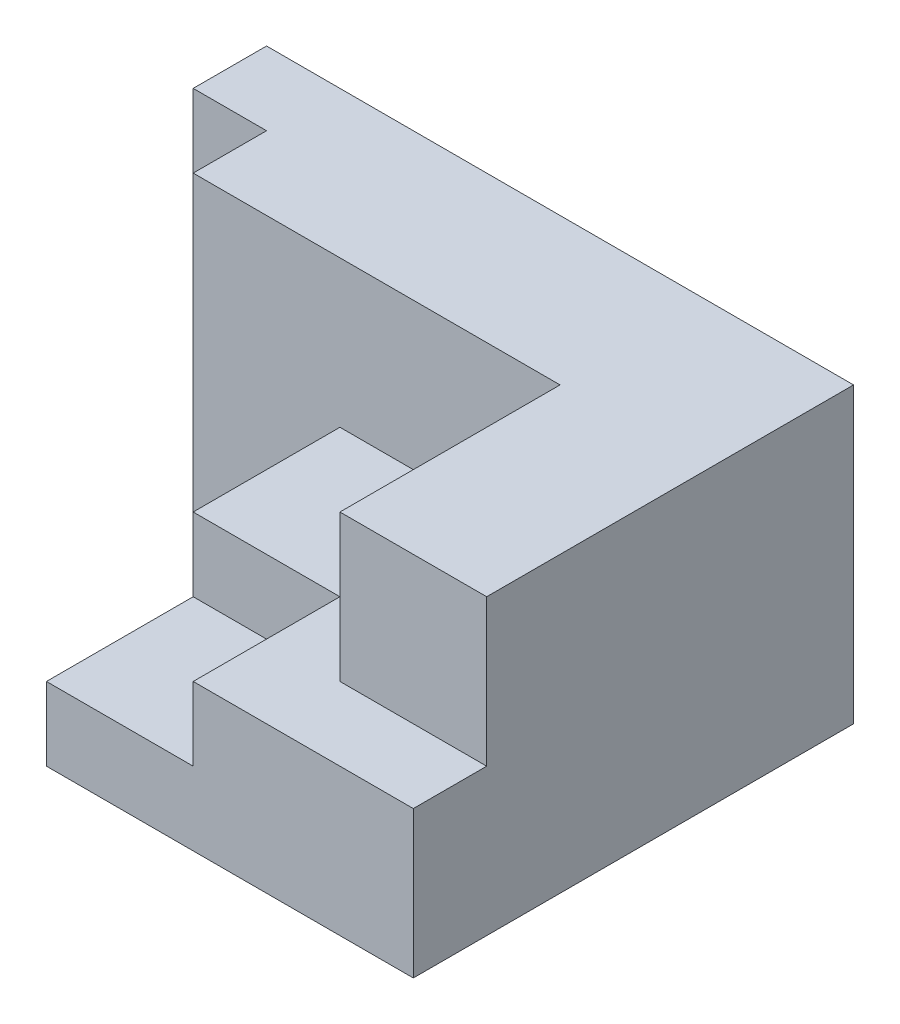
ISO-10303-21;
HEADER;
FILE_DESCRIPTION(('STEP AP214'),'2;1');
FILE_NAME('part.step','',(''),(''),'','','');
FILE_SCHEMA(('AUTOMOTIVE_DESIGN { 1 0 10303 214 1 1 1 1 }'));
ENDSEC;
DATA;
#1=APPLICATION_CONTEXT('core data for automotive mechanical design processes');
#2=APPLICATION_PROTOCOL_DEFINITION('international standard','automotive_design',2000,#1);
#3=PRODUCT_CONTEXT('',#1,'mechanical');
#4=PRODUCT('Part','Part','',(#3));
#5=PRODUCT_RELATED_PRODUCT_CATEGORY('part','',(#4));
#6=PRODUCT_DEFINITION_FORMATION('','',#4);
#7=PRODUCT_DEFINITION_CONTEXT('part definition',#1,'design');
#8=PRODUCT_DEFINITION('design','',#6,#7);
#9=PRODUCT_DEFINITION_SHAPE('','',#8);
#10=(LENGTH_UNIT() NAMED_UNIT(*) SI_UNIT(.MILLI.,.METRE.));
#11=(NAMED_UNIT(*) PLANE_ANGLE_UNIT() SI_UNIT($,.RADIAN.));
#12=(NAMED_UNIT(*) SI_UNIT($,.STERADIAN.) SOLID_ANGLE_UNIT());
#13=UNCERTAINTY_MEASURE_WITH_UNIT(LENGTH_MEASURE(1.E-05),#10,'distance_accuracy_value','');
#14=(GEOMETRIC_REPRESENTATION_CONTEXT(3) GLOBAL_UNCERTAINTY_ASSIGNED_CONTEXT((#13)) GLOBAL_UNIT_ASSIGNED_CONTEXT((#10,
#11,#12)) REPRESENTATION_CONTEXT('',''));
#15=CARTESIAN_POINT('',(0.,0.,0.));
#16=DIRECTION('',(0.,0.,1.));
#17=DIRECTION('',(1.,0.,0.));
#18=AXIS2_PLACEMENT_3D('',#15,#16,#17);
#19=CARTESIAN_POINT('',(0.,40.,10.));
#20=DIRECTION('',(1.,0.,0.));
#21=DIRECTION('',(0.,0.,-1.));
#22=AXIS2_PLACEMENT_3D('',#19,#20,#21);
#23=PLANE('',#22);
#24=DIRECTION('',(0.,0.,1.));
#25=VECTOR('',#24,1.);
#26=CARTESIAN_POINT('',(0.,0.,10.));
#27=LINE('',#26,#25);
#28=CARTESIAN_POINT('',(0.,0.,0.));
#29=VERTEX_POINT('',#28);
#30=CARTESIAN_POINT('',(0.,0.,10.));
#31=VERTEX_POINT('',#30);
#32=EDGE_CURVE('E191',#29,#31,#27,.T.);
#33=ORIENTED_EDGE('',*,*,#32,.T.);
#34=DIRECTION('',(0.,-1.,0.));
#35=VECTOR('',#34,1.);
#36=CARTESIAN_POINT('',(0.,40.,10.));
#37=LINE('',#36,#35);
#38=CARTESIAN_POINT('',(0.,40.,10.));
#39=VERTEX_POINT('',#38);
#40=EDGE_CURVE('E11',#39,#31,#37,.T.);
#41=ORIENTED_EDGE('',*,*,#40,.F.);
#42=DIRECTION('',(0.,0.,1.));
#43=VECTOR('',#42,1.);
#44=CARTESIAN_POINT('',(0.,40.,10.));
#45=LINE('',#44,#43);
#46=CARTESIAN_POINT('',(0.,40.,0.));
#47=VERTEX_POINT('',#46);
#48=EDGE_CURVE('E202',#47,#39,#45,.T.);
#49=ORIENTED_EDGE('',*,*,#48,.F.);
#50=DIRECTION('',(0.,-1.,0.));
#51=VECTOR('',#50,1.);
#52=CARTESIAN_POINT('',(0.,40.,0.));
#53=LINE('',#52,#51);
#54=EDGE_CURVE('E203',#47,#29,#53,.T.);
#55=ORIENTED_EDGE('',*,*,#54,.T.);
#56=EDGE_LOOP('',(#33,#41,#49,#55));
#57=FACE_BOUND('',#56,.T.);
#58=ADVANCED_FACE('F35',(#57),#23,.F.);
#59=CARTESIAN_POINT('',(10.,40.,10.));
#60=DIRECTION('',(0.,0.,-1.));
#61=DIRECTION('',(-1.,0.,0.));
#62=AXIS2_PLACEMENT_3D('',#59,#60,#61);
#63=PLANE('',#62);
#64=DIRECTION('',(1.,0.,0.));
#65=VECTOR('',#64,1.);
#66=CARTESIAN_POINT('',(10.,0.,10.));
#67=LINE('',#66,#65);
#68=CARTESIAN_POINT('',(10.,0.,10.));
#69=VERTEX_POINT('',#68);
#70=EDGE_CURVE('E186',#31,#69,#67,.T.);
#71=ORIENTED_EDGE('',*,*,#70,.T.);
#72=DIRECTION('',(0.,-1.,0.));
#73=VECTOR('',#72,1.);
#74=CARTESIAN_POINT('',(10.,40.,10.));
#75=LINE('',#74,#73);
#76=CARTESIAN_POINT('',(10.,40.,10.));
#77=VERTEX_POINT('',#76);
#78=EDGE_CURVE('E42',#77,#69,#75,.T.);
#79=ORIENTED_EDGE('',*,*,#78,.F.);
#80=DIRECTION('',(1.,0.,0.));
#81=VECTOR('',#80,1.);
#82=CARTESIAN_POINT('',(10.,40.,10.));
#83=LINE('',#82,#81);
#84=EDGE_CURVE('E230',#39,#77,#83,.T.);
#85=ORIENTED_EDGE('',*,*,#84,.F.);
#86=ORIENTED_EDGE('',*,*,#40,.T.);
#87=EDGE_LOOP('',(#71,#79,#85,#86));
#88=FACE_BOUND('',#87,.T.);
#89=ADVANCED_FACE('F292',(#88),#63,.F.);
#90=CARTESIAN_POINT('',(10.,40.,20.));
#91=DIRECTION('',(1.,0.,0.));
#92=DIRECTION('',(0.,0.,-1.));
#93=AXIS2_PLACEMENT_3D('',#90,#91,#92);
#94=PLANE('',#93);
#95=DIRECTION('',(0.,0.,1.));
#96=VECTOR('',#95,1.);
#97=CARTESIAN_POINT('',(10.,0.,20.));
#98=LINE('',#97,#96);
#99=CARTESIAN_POINT('',(10.,0.,20.));
#100=VERTEX_POINT('',#99);
#101=EDGE_CURVE('E179',#69,#100,#98,.T.);
#102=ORIENTED_EDGE('',*,*,#101,.T.);
#103=DIRECTION('',(0.,-1.,0.));
#104=VECTOR('',#103,1.);
#105=CARTESIAN_POINT('',(10.,40.,20.));
#106=LINE('',#105,#104);
#107=CARTESIAN_POINT('',(10.,40.,20.));
#108=VERTEX_POINT('',#107);
#109=EDGE_CURVE('E165',#108,#100,#106,.T.);
#110=ORIENTED_EDGE('',*,*,#109,.F.);
#111=DIRECTION('',(0.,0.,1.));
#112=VECTOR('',#111,1.);
#113=CARTESIAN_POINT('',(10.,40.,20.));
#114=LINE('',#113,#112);
#115=EDGE_CURVE('E180',#77,#108,#114,.T.);
#116=ORIENTED_EDGE('',*,*,#115,.F.);
#117=ORIENTED_EDGE('',*,*,#78,.T.);
#118=EDGE_LOOP('',(#102,#110,#116,#117));
#119=FACE_BOUND('',#118,.T.);
#120=ADVANCED_FACE('F177',(#119),#94,.F.);
#121=CARTESIAN_POINT('',(30.,40.,20.));
#122=DIRECTION('',(0.,0.,-1.));
#123=DIRECTION('',(-1.,0.,0.));
#124=AXIS2_PLACEMENT_3D('',#121,#122,#123);
#125=PLANE('',#124);
#126=DIRECTION('',(1.,0.,0.));
#127=VECTOR('',#126,1.);
#128=CARTESIAN_POINT('',(30.,0.,20.));
#129=LINE('',#128,#127);
#130=CARTESIAN_POINT('',(30.,0.,20.));
#131=VERTEX_POINT('',#130);
#132=EDGE_CURVE('E188',#100,#131,#129,.T.);
#133=ORIENTED_EDGE('',*,*,#132,.T.);
#134=DIRECTION('',(0.,-1.,0.));
#135=VECTOR('',#134,1.);
#136=CARTESIAN_POINT('',(30.,40.,20.));
#137=LINE('',#136,#135);
#138=CARTESIAN_POINT('',(30.,20.,20.));
#139=VERTEX_POINT('',#138);
#140=EDGE_CURVE('E162',#139,#131,#137,.T.);
#141=ORIENTED_EDGE('',*,*,#140,.F.);
#142=DIRECTION('',(-1.,0.,0.));
#143=VECTOR('',#142,1.);
#144=CARTESIAN_POINT('',(30.,20.,20.));
#145=LINE('',#144,#143);
#146=CARTESIAN_POINT('',(60.,20.,20.));
#147=VERTEX_POINT('',#146);
#148=EDGE_CURVE('E248',#147,#139,#145,.T.);
#149=ORIENTED_EDGE('',*,*,#148,.F.);
#150=DIRECTION('',(0.,1.,0.));
#151=VECTOR('',#150,1.);
#152=CARTESIAN_POINT('',(60.,20.,20.));
#153=LINE('',#152,#151);
#154=CARTESIAN_POINT('',(60.,40.,20.));
#155=VERTEX_POINT('',#154);
#156=EDGE_CURVE('E219',#147,#155,#153,.T.);
#157=ORIENTED_EDGE('',*,*,#156,.T.);
#158=DIRECTION('',(1.,0.,0.));
#159=VECTOR('',#158,1.);
#160=CARTESIAN_POINT('',(30.,40.,20.));
#161=LINE('',#160,#159);
#162=EDGE_CURVE('E227',#108,#155,#161,.T.);
#163=ORIENTED_EDGE('',*,*,#162,.F.);
#164=ORIENTED_EDGE('',*,*,#109,.T.);
#165=EDGE_LOOP('',(#133,#141,#149,#157,#163,#164));
#166=FACE_BOUND('',#165,.T.);
#167=ADVANCED_FACE('F276',(#166),#125,.F.);
#168=CARTESIAN_POINT('',(30.,40.,60.));
#169=DIRECTION('',(1.,0.,0.));
#170=DIRECTION('',(0.,0.,-1.));
#171=AXIS2_PLACEMENT_3D('',#168,#169,#170);
#172=PLANE('',#171);
#173=DIRECTION('',(0.,0.,1.));
#174=VECTOR('',#173,1.);
#175=CARTESIAN_POINT('',(30.,10.,60.));
#176=LINE('',#175,#174);
#177=CARTESIAN_POINT('',(30.,10.,40.));
#178=VERTEX_POINT('',#177);
#179=CARTESIAN_POINT('',(30.,10.,60.));
#180=VERTEX_POINT('',#179);
#181=EDGE_CURVE('E138',#178,#180,#176,.T.);
#182=ORIENTED_EDGE('',*,*,#181,.F.);
#183=DIRECTION('',(0.,1.,0.));
#184=VECTOR('',#183,1.);
#185=CARTESIAN_POINT('',(30.,10.,40.));
#186=LINE('',#185,#184);
#187=CARTESIAN_POINT('',(30.,20.,40.));
#188=VERTEX_POINT('',#187);
#189=EDGE_CURVE('E243',#178,#188,#186,.T.);
#190=ORIENTED_EDGE('',*,*,#189,.T.);
#191=DIRECTION('',(0.,0.,1.));
#192=VECTOR('',#191,1.);
#193=CARTESIAN_POINT('',(30.,20.,60.));
#194=LINE('',#193,#192);
#195=EDGE_CURVE('E245',#139,#188,#194,.T.);
#196=ORIENTED_EDGE('',*,*,#195,.F.);
#197=ORIENTED_EDGE('',*,*,#140,.T.);
#198=DIRECTION('',(0.,0.,1.));
#199=VECTOR('',#198,1.);
#200=CARTESIAN_POINT('',(30.,0.,60.));
#201=LINE('',#200,#199);
#202=CARTESIAN_POINT('',(30.,0.,60.));
#203=VERTEX_POINT('',#202);
#204=EDGE_CURVE('E160',#131,#203,#201,.T.);
#205=ORIENTED_EDGE('',*,*,#204,.T.);
#206=DIRECTION('',(0.,-1.,0.));
#207=VECTOR('',#206,1.);
#208=CARTESIAN_POINT('',(30.,40.,60.));
#209=LINE('',#208,#207);
#210=EDGE_CURVE('E154',#180,#203,#209,.T.);
#211=ORIENTED_EDGE('',*,*,#210,.F.);
#212=EDGE_LOOP('',(#182,#190,#196,#197,#205,#211));
#213=FACE_BOUND('',#212,.T.);
#214=ADVANCED_FACE('F158',(#213),#172,.F.);
#215=CARTESIAN_POINT('',(80.,40.,60.));
#216=DIRECTION('',(0.,0.,-1.));
#217=DIRECTION('',(-1.,0.,0.));
#218=AXIS2_PLACEMENT_3D('',#215,#216,#217);
#219=PLANE('',#218);
#220=DIRECTION('',(1.,0.,0.));
#221=VECTOR('',#220,1.);
#222=CARTESIAN_POINT('',(80.,20.,60.));
#223=LINE('',#222,#221);
#224=CARTESIAN_POINT('',(50.,20.,60.));
#225=VERTEX_POINT('',#224);
#226=CARTESIAN_POINT('',(80.,20.,60.));
#227=VERTEX_POINT('',#226);
#228=EDGE_CURVE('E235',#225,#227,#223,.T.);
#229=ORIENTED_EDGE('',*,*,#228,.F.);
#230=DIRECTION('',(0.,1.,0.));
#231=VECTOR('',#230,1.);
#232=CARTESIAN_POINT('',(50.,10.,60.));
#233=LINE('',#232,#231);
#234=CARTESIAN_POINT('',(50.,10.,60.));
#235=VERTEX_POINT('',#234);
#236=EDGE_CURVE('E49',#235,#225,#233,.T.);
#237=ORIENTED_EDGE('',*,*,#236,.F.);
#238=DIRECTION('',(1.,0.,0.));
#239=VECTOR('',#238,1.);
#240=CARTESIAN_POINT('',(30.,10.,60.));
#241=LINE('',#240,#239);
#242=EDGE_CURVE('E142',#180,#235,#241,.T.);
#243=ORIENTED_EDGE('',*,*,#242,.F.);
#244=ORIENTED_EDGE('',*,*,#210,.T.);
#245=DIRECTION('',(1.,0.,0.));
#246=VECTOR('',#245,1.);
#247=CARTESIAN_POINT('',(80.,0.,60.));
#248=LINE('',#247,#246);
#249=CARTESIAN_POINT('',(80.,0.,60.));
#250=VERTEX_POINT('',#249);
#251=EDGE_CURVE('E196',#203,#250,#248,.T.);
#252=ORIENTED_EDGE('',*,*,#251,.T.);
#253=DIRECTION('',(0.,-1.,0.));
#254=VECTOR('',#253,1.);
#255=CARTESIAN_POINT('',(80.,40.,60.));
#256=LINE('',#255,#254);
#257=EDGE_CURVE('E163',#227,#250,#256,.T.);
#258=ORIENTED_EDGE('',*,*,#257,.F.);
#259=EDGE_LOOP('',(#229,#237,#243,#244,#252,#258));
#260=FACE_BOUND('',#259,.T.);
#261=ADVANCED_FACE('F152',(#260),#219,.F.);
#262=CARTESIAN_POINT('',(80.,40.,0.));
#263=DIRECTION('',(-1.,0.,0.));
#264=DIRECTION('',(0.,0.,1.));
#265=AXIS2_PLACEMENT_3D('',#262,#263,#264);
#266=PLANE('',#265);
#267=DIRECTION('',(0.,0.,-1.));
#268=VECTOR('',#267,1.);
#269=CARTESIAN_POINT('',(80.,40.,0.));
#270=LINE('',#269,#268);
#271=CARTESIAN_POINT('',(80.,40.,50.));
#272=VERTEX_POINT('',#271);
#273=CARTESIAN_POINT('',(80.,40.,0.));
#274=VERTEX_POINT('',#273);
#275=EDGE_CURVE('E225',#272,#274,#270,.T.);
#276=ORIENTED_EDGE('',*,*,#275,.F.);
#277=DIRECTION('',(0.,1.,0.));
#278=VECTOR('',#277,1.);
#279=CARTESIAN_POINT('',(80.,20.,50.));
#280=LINE('',#279,#278);
#281=CARTESIAN_POINT('',(80.,20.,50.));
#282=VERTEX_POINT('',#281);
#283=EDGE_CURVE('E57',#282,#272,#280,.T.);
#284=ORIENTED_EDGE('',*,*,#283,.F.);
#285=DIRECTION('',(0.,0.,-1.));
#286=VECTOR('',#285,1.);
#287=CARTESIAN_POINT('',(80.,20.,50.));
#288=LINE('',#287,#286);
#289=EDGE_CURVE('E240',#227,#282,#288,.T.);
#290=ORIENTED_EDGE('',*,*,#289,.F.);
#291=ORIENTED_EDGE('',*,*,#257,.T.);
#292=DIRECTION('',(0.,0.,-1.));
#293=VECTOR('',#292,1.);
#294=CARTESIAN_POINT('',(80.,0.,0.));
#295=LINE('',#294,#293);
#296=CARTESIAN_POINT('',(80.,0.,0.));
#297=VERTEX_POINT('',#296);
#298=EDGE_CURVE('E198',#250,#297,#295,.T.);
#299=ORIENTED_EDGE('',*,*,#298,.T.);
#300=DIRECTION('',(0.,-1.,0.));
#301=VECTOR('',#300,1.);
#302=CARTESIAN_POINT('',(80.,40.,0.));
#303=LINE('',#302,#301);
#304=EDGE_CURVE('E167',#274,#297,#303,.T.);
#305=ORIENTED_EDGE('',*,*,#304,.F.);
#306=EDGE_LOOP('',(#276,#284,#290,#291,#299,#305));
#307=FACE_BOUND('',#306,.T.);
#308=ADVANCED_FACE('F280',(#307),#266,.F.);
#309=CARTESIAN_POINT('',(0.,40.,0.));
#310=DIRECTION('',(0.,0.,1.));
#311=DIRECTION('',(1.,0.,0.));
#312=AXIS2_PLACEMENT_3D('',#309,#310,#311);
#313=PLANE('',#312);
#314=DIRECTION('',(-1.,0.,0.));
#315=VECTOR('',#314,1.);
#316=CARTESIAN_POINT('',(0.,0.,0.));
#317=LINE('',#316,#315);
#318=EDGE_CURVE('E200',#297,#29,#317,.T.);
#319=ORIENTED_EDGE('',*,*,#318,.T.);
#320=ORIENTED_EDGE('',*,*,#54,.F.);
#321=DIRECTION('',(-1.,0.,0.));
#322=VECTOR('',#321,1.);
#323=CARTESIAN_POINT('',(0.,40.,0.));
#324=LINE('',#323,#322);
#325=EDGE_CURVE('E205',#274,#47,#324,.T.);
#326=ORIENTED_EDGE('',*,*,#325,.F.);
#327=ORIENTED_EDGE('',*,*,#304,.T.);
#328=EDGE_LOOP('',(#319,#320,#326,#327));
#329=FACE_BOUND('',#328,.T.);
#330=ADVANCED_FACE('F211',(#329),#313,.F.);
#331=CARTESIAN_POINT('',(0.,40.,0.));
#332=DIRECTION('',(0.,-1.,0.));
#333=DIRECTION('',(0.,0.,-1.));
#334=AXIS2_PLACEMENT_3D('',#331,#332,#333);
#335=PLANE('',#334);
#336=ORIENTED_EDGE('',*,*,#162,.T.);
#337=DIRECTION('',(0.,0.,-1.));
#338=VECTOR('',#337,1.);
#339=CARTESIAN_POINT('',(60.,40.,20.));
#340=LINE('',#339,#338);
#341=CARTESIAN_POINT('',(60.,40.,50.));
#342=VERTEX_POINT('',#341);
#343=EDGE_CURVE('E237',#342,#155,#340,.T.);
#344=ORIENTED_EDGE('',*,*,#343,.F.);
#345=DIRECTION('',(-1.,0.,0.));
#346=VECTOR('',#345,1.);
#347=CARTESIAN_POINT('',(60.,40.,50.));
#348=LINE('',#347,#346);
#349=EDGE_CURVE('E241',#272,#342,#348,.T.);
#350=ORIENTED_EDGE('',*,*,#349,.F.);
#351=ORIENTED_EDGE('',*,*,#275,.T.);
#352=ORIENTED_EDGE('',*,*,#325,.T.);
#353=ORIENTED_EDGE('',*,*,#48,.T.);
#354=ORIENTED_EDGE('',*,*,#84,.T.);
#355=ORIENTED_EDGE('',*,*,#115,.T.);
#356=EDGE_LOOP('',(#336,#344,#350,#351,#352,#353,#354,#355));
#357=FACE_BOUND('',#356,.T.);
#358=ADVANCED_FACE('F311',(#357),#335,.F.);
#359=CARTESIAN_POINT('',(0.,0.,0.));
#360=DIRECTION('',(0.,-1.,0.));
#361=DIRECTION('',(0.,0.,-1.));
#362=AXIS2_PLACEMENT_3D('',#359,#360,#361);
#363=PLANE('',#362);
#364=ORIENTED_EDGE('',*,*,#32,.F.);
#365=ORIENTED_EDGE('',*,*,#318,.F.);
#366=ORIENTED_EDGE('',*,*,#298,.F.);
#367=ORIENTED_EDGE('',*,*,#251,.F.);
#368=ORIENTED_EDGE('',*,*,#204,.F.);
#369=ORIENTED_EDGE('',*,*,#132,.F.);
#370=ORIENTED_EDGE('',*,*,#101,.F.);
#371=ORIENTED_EDGE('',*,*,#70,.F.);
#372=EDGE_LOOP('',(#364,#365,#366,#367,#368,#369,#370,#371));
#373=FACE_BOUND('',#372,.T.);
#374=ADVANCED_FACE('F185',(#373),#363,.T.);
#375=CARTESIAN_POINT('',(60.,20.,20.));
#376=DIRECTION('',(1.,0.,0.));
#377=DIRECTION('',(0.,0.,-1.));
#378=AXIS2_PLACEMENT_3D('',#375,#376,#377);
#379=PLANE('',#378);
#380=ORIENTED_EDGE('',*,*,#343,.T.);
#381=ORIENTED_EDGE('',*,*,#156,.F.);
#382=DIRECTION('',(0.,0.,-1.));
#383=VECTOR('',#382,1.);
#384=CARTESIAN_POINT('',(60.,20.,20.));
#385=LINE('',#384,#383);
#386=CARTESIAN_POINT('',(60.,20.,50.));
#387=VERTEX_POINT('',#386);
#388=EDGE_CURVE('E250',#387,#147,#385,.T.);
#389=ORIENTED_EDGE('',*,*,#388,.F.);
#390=DIRECTION('',(0.,1.,0.));
#391=VECTOR('',#390,1.);
#392=CARTESIAN_POINT('',(60.,20.,50.));
#393=LINE('',#392,#391);
#394=EDGE_CURVE('E221',#387,#342,#393,.T.);
#395=ORIENTED_EDGE('',*,*,#394,.T.);
#396=EDGE_LOOP('',(#380,#381,#389,#395));
#397=FACE_BOUND('',#396,.T.);
#398=ADVANCED_FACE('F314',(#397),#379,.F.);
#399=CARTESIAN_POINT('',(60.,20.,50.));
#400=DIRECTION('',(0.,0.,-1.));
#401=DIRECTION('',(-1.,0.,0.));
#402=AXIS2_PLACEMENT_3D('',#399,#400,#401);
#403=PLANE('',#402);
#404=ORIENTED_EDGE('',*,*,#349,.T.);
#405=ORIENTED_EDGE('',*,*,#394,.F.);
#406=DIRECTION('',(-1.,0.,0.));
#407=VECTOR('',#406,1.);
#408=CARTESIAN_POINT('',(60.,20.,50.));
#409=LINE('',#408,#407);
#410=EDGE_CURVE('E253',#282,#387,#409,.T.);
#411=ORIENTED_EDGE('',*,*,#410,.F.);
#412=ORIENTED_EDGE('',*,*,#283,.T.);
#413=EDGE_LOOP('',(#404,#405,#411,#412));
#414=FACE_BOUND('',#413,.T.);
#415=ADVANCED_FACE('F318',(#414),#403,.F.);
#416=CARTESIAN_POINT('',(0.,20.,0.));
#417=DIRECTION('',(0.,-1.,0.));
#418=DIRECTION('',(0.,0.,-1.));
#419=AXIS2_PLACEMENT_3D('',#416,#417,#418);
#420=PLANE('',#419);
#421=ORIENTED_EDGE('',*,*,#195,.T.);
#422=DIRECTION('',(-1.,0.,0.));
#423=VECTOR('',#422,1.);
#424=CARTESIAN_POINT('',(30.,20.,40.));
#425=LINE('',#424,#423);
#426=CARTESIAN_POINT('',(50.,20.,40.));
#427=VERTEX_POINT('',#426);
#428=EDGE_CURVE('E148',#427,#188,#425,.T.);
#429=ORIENTED_EDGE('',*,*,#428,.F.);
#430=DIRECTION('',(0.,0.,-1.));
#431=VECTOR('',#430,1.);
#432=CARTESIAN_POINT('',(50.,20.,60.));
#433=LINE('',#432,#431);
#434=EDGE_CURVE('E263',#225,#427,#433,.T.);
#435=ORIENTED_EDGE('',*,*,#434,.F.);
#436=ORIENTED_EDGE('',*,*,#228,.T.);
#437=ORIENTED_EDGE('',*,*,#289,.T.);
#438=ORIENTED_EDGE('',*,*,#410,.T.);
#439=ORIENTED_EDGE('',*,*,#388,.T.);
#440=ORIENTED_EDGE('',*,*,#148,.T.);
#441=EDGE_LOOP('',(#421,#429,#435,#436,#437,#438,#439,#440));
#442=FACE_BOUND('',#441,.T.);
#443=ADVANCED_FACE('F272',(#442),#420,.F.);
#444=CARTESIAN_POINT('',(30.,10.,40.));
#445=DIRECTION('',(0.,0.,-1.));
#446=DIRECTION('',(-1.,0.,0.));
#447=AXIS2_PLACEMENT_3D('',#444,#445,#446);
#448=PLANE('',#447);
#449=ORIENTED_EDGE('',*,*,#428,.T.);
#450=ORIENTED_EDGE('',*,*,#189,.F.);
#451=DIRECTION('',(-1.,0.,0.));
#452=VECTOR('',#451,1.);
#453=CARTESIAN_POINT('',(30.,10.,40.));
#454=LINE('',#453,#452);
#455=CARTESIAN_POINT('',(50.,10.,40.));
#456=VERTEX_POINT('',#455);
#457=EDGE_CURVE('E144',#456,#178,#454,.T.);
#458=ORIENTED_EDGE('',*,*,#457,.F.);
#459=DIRECTION('',(0.,1.,0.));
#460=VECTOR('',#459,1.);
#461=CARTESIAN_POINT('',(50.,10.,40.));
#462=LINE('',#461,#460);
#463=EDGE_CURVE('E259',#456,#427,#462,.T.);
#464=ORIENTED_EDGE('',*,*,#463,.T.);
#465=EDGE_LOOP('',(#449,#450,#458,#464));
#466=FACE_BOUND('',#465,.T.);
#467=ADVANCED_FACE('F267',(#466),#448,.F.);
#468=CARTESIAN_POINT('',(50.,10.,60.));
#469=DIRECTION('',(1.,0.,0.));
#470=DIRECTION('',(0.,0.,-1.));
#471=AXIS2_PLACEMENT_3D('',#468,#469,#470);
#472=PLANE('',#471);
#473=ORIENTED_EDGE('',*,*,#434,.T.);
#474=ORIENTED_EDGE('',*,*,#463,.F.);
#475=DIRECTION('',(0.,0.,-1.));
#476=VECTOR('',#475,1.);
#477=CARTESIAN_POINT('',(50.,10.,60.));
#478=LINE('',#477,#476);
#479=EDGE_CURVE('E156',#235,#456,#478,.T.);
#480=ORIENTED_EDGE('',*,*,#479,.F.);
#481=ORIENTED_EDGE('',*,*,#236,.T.);
#482=EDGE_LOOP('',(#473,#474,#480,#481));
#483=FACE_BOUND('',#482,.T.);
#484=ADVANCED_FACE('F281',(#483),#472,.F.);
#485=CARTESIAN_POINT('',(0.,10.,0.));
#486=DIRECTION('',(0.,-1.,0.));
#487=DIRECTION('',(0.,0.,-1.));
#488=AXIS2_PLACEMENT_3D('',#485,#486,#487);
#489=PLANE('',#488);
#490=ORIENTED_EDGE('',*,*,#181,.T.);
#491=ORIENTED_EDGE('',*,*,#242,.T.);
#492=ORIENTED_EDGE('',*,*,#479,.T.);
#493=ORIENTED_EDGE('',*,*,#457,.T.);
#494=EDGE_LOOP('',(#490,#491,#492,#493));
#495=FACE_BOUND('',#494,.T.);
#496=ADVANCED_FACE('F140',(#495),#489,.F.);
#497=CLOSED_SHELL('',(#58,#89,#120,#167,#214,#261,#308,#330,#358,#374,#398,#415,#443,#467,#484,#496));
#498=MANIFOLD_SOLID_BREP('B2',#497);
#499=ADVANCED_BREP_SHAPE_REPRESENTATION('',(#18,#498),#14);
#500=SHAPE_DEFINITION_REPRESENTATION(#9,#499);
ENDSEC;
END-ISO-10303-21;
